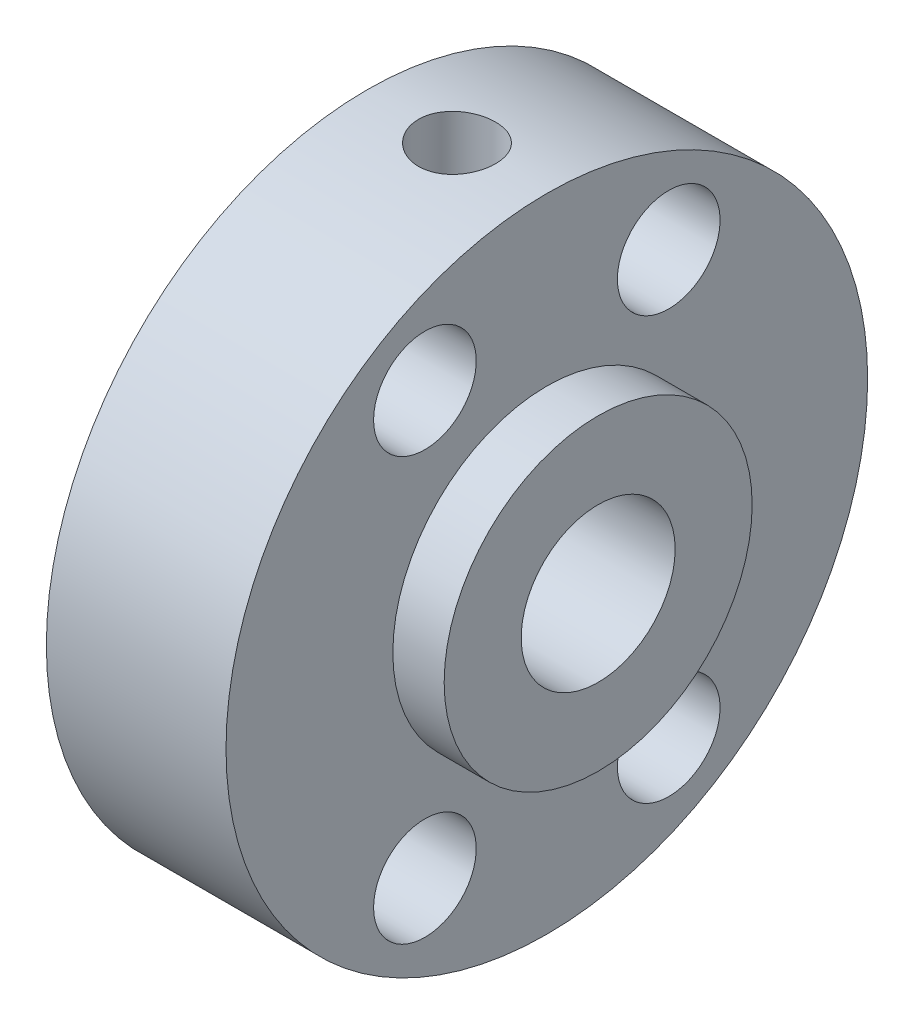
ISO-10303-21;
HEADER;
FILE_DESCRIPTION(('STEP AP214'),'2;1');
FILE_NAME('part.step','',(''),(''),'','','');
FILE_SCHEMA(('AUTOMOTIVE_DESIGN { 1 0 10303 214 1 1 1 1 }'));
ENDSEC;
DATA;
#1=APPLICATION_CONTEXT('core data for automotive mechanical design processes');
#2=APPLICATION_PROTOCOL_DEFINITION('international standard','automotive_design',2000,#1);
#3=PRODUCT_CONTEXT('',#1,'mechanical');
#4=PRODUCT('Part','Part','',(#3));
#5=PRODUCT_RELATED_PRODUCT_CATEGORY('part','',(#4));
#6=PRODUCT_DEFINITION_FORMATION('','',#4);
#7=PRODUCT_DEFINITION_CONTEXT('part definition',#1,'design');
#8=PRODUCT_DEFINITION('design','',#6,#7);
#9=PRODUCT_DEFINITION_SHAPE('','',#8);
#10=(LENGTH_UNIT() NAMED_UNIT(*) SI_UNIT(.MILLI.,.METRE.));
#11=(NAMED_UNIT(*) PLANE_ANGLE_UNIT() SI_UNIT($,.RADIAN.));
#12=(NAMED_UNIT(*) SI_UNIT($,.STERADIAN.) SOLID_ANGLE_UNIT());
#13=UNCERTAINTY_MEASURE_WITH_UNIT(LENGTH_MEASURE(1.E-05),#10,'distance_accuracy_value','');
#14=(GEOMETRIC_REPRESENTATION_CONTEXT(3) GLOBAL_UNCERTAINTY_ASSIGNED_CONTEXT((#13)) GLOBAL_UNIT_ASSIGNED_CONTEXT((#10,
#11,#12)) REPRESENTATION_CONTEXT('',''));
#15=CARTESIAN_POINT('',(0.,0.,0.));
#16=DIRECTION('',(0.,0.,1.));
#17=DIRECTION('',(1.,0.,0.));
#18=AXIS2_PLACEMENT_3D('',#15,#16,#17);
#19=CARTESIAN_POINT('',(0.,0.,0.));
#20=DIRECTION('',(-1.,0.,0.));
#21=DIRECTION('',(0.,0.,-1.));
#22=AXIS2_PLACEMENT_3D('',#19,#20,#21);
#23=CYLINDRICAL_SURFACE('',#22,3.);
#24=CARTESIAN_POINT('',(9.,0.,0.));
#25=DIRECTION('',(1.,0.,0.));
#26=DIRECTION('',(0.,0.,-1.));
#27=AXIS2_PLACEMENT_3D('',#24,#25,#26);
#28=CIRCLE('',#27,3.);
#29=CARTESIAN_POINT('',(9.,0.,-3.));
#30=VERTEX_POINT('',#29);
#31=EDGE_CURVE('E61',#30,#30,#28,.T.);
#32=ORIENTED_EDGE('',*,*,#31,.T.);
#33=EDGE_LOOP('',(#32));
#34=FACE_BOUND('',#33,.T.);
#35=CARTESIAN_POINT('',(0.,0.,0.));
#36=DIRECTION('',(1.,0.,0.));
#37=DIRECTION('',(0.,0.,-1.));
#38=AXIS2_PLACEMENT_3D('',#35,#36,#37);
#39=CIRCLE('',#38,3.);
#40=CARTESIAN_POINT('',(0.,0.,-3.));
#41=VERTEX_POINT('',#40);
#42=EDGE_CURVE('E10',#41,#41,#39,.T.);
#43=ORIENTED_EDGE('',*,*,#42,.F.);
#44=EDGE_LOOP('',(#43));
#45=FACE_BOUND('',#44,.T.);
#46=CARTESIAN_POINT('',(3.5,2.59807621135332,1.5));
#47=CARTESIAN_POINT('',(3.57816171229288,2.59808302092689,1.4999945446118));
#48=CARTESIAN_POINT('',(3.65642211728757,2.60165701781635,1.49384995609982));
#49=CARTESIAN_POINT('',(3.81054089701573,2.61543549678079,1.46958481484708));
#50=CARTESIAN_POINT('',(3.88639387256511,2.62565391083339,1.45143909683127));
#51=CARTESIAN_POINT('',(4.03317749651591,2.65124019908098,1.40414992304972));
#52=CARTESIAN_POINT('',(4.10413197871038,2.66658065209878,1.3750649287406));
#53=CARTESIAN_POINT('',(4.24013630299508,2.70063997225287,1.30690128806456));
#54=CARTESIAN_POINT('',(4.30518582539369,2.71935902214097,1.26782210105366));
#55=CARTESIAN_POINT('',(4.43345859283626,2.75995303586162,1.17699981079632));
#56=CARTESIAN_POINT('',(4.49608870351032,2.7819609545693,1.12447805421565));
#57=CARTESIAN_POINT('',(4.61211258261006,2.82557974178559,1.0098807114217));
#58=CARTESIAN_POINT('',(4.66550174387528,2.84719040746875,0.947800388673439));
#59=CARTESIAN_POINT('',(4.76505072672149,2.88932215429424,0.810734345121818));
#60=CARTESIAN_POINT('',(4.81048065178929,2.90967159627259,0.735160783518861));
#61=CARTESIAN_POINT('',(4.88771127986864,2.94526134149293,0.576235539899255));
#62=CARTESIAN_POINT('',(4.91952058420575,2.96050486775612,0.492888807207232));
#63=CARTESIAN_POINT('',(4.96625699195164,2.98320691866356,0.327067415888966));
#64=CARTESIAN_POINT('',(4.9822242895333,2.99114220331338,0.244952685733226));
#65=CARTESIAN_POINT('',(5.00024917801256,3.000113757691,0.0788559430467724));
#66=CARTESIAN_POINT('',(5.00231518519356,3.00115420176885,-0.00512490876560744));
#67=CARTESIAN_POINT('',(4.99287998904448,2.99644472874675,-0.164748786635625));
#68=CARTESIAN_POINT('',(4.98254297671817,2.99127743838241,-0.240481798765187));
#69=CARTESIAN_POINT('',(4.95067873414301,2.97561367889621,-0.388970657877483));
#70=CARTESIAN_POINT('',(4.92915066653566,2.96511681099591,-0.461726281640888));
#71=CARTESIAN_POINT('',(4.87537615086528,2.93957374931482,-0.60346408735433));
#72=CARTESIAN_POINT('',(4.8429855302419,2.92446662293799,-0.672380135272767));
#73=CARTESIAN_POINT('',(4.76860487569776,2.89106468980031,-0.803965202269992));
#74=CARTESIAN_POINT('',(4.72661140504647,2.87276874236226,-0.866631973257968));
#75=CARTESIAN_POINT('',(4.62965697270048,2.83266591598844,-0.990260491347292));
#76=CARTESIAN_POINT('',(4.57384545751099,2.81069063997263,-1.05050111254404));
#77=CARTESIAN_POINT('',(4.45311541260473,2.76681510880218,-1.16115655544667));
#78=CARTESIAN_POINT('',(4.38818994158891,2.74491492398443,-1.21156381736135));
#79=CARTESIAN_POINT('',(4.24602771136387,2.70216234138727,-1.30425800196332));
#80=CARTESIAN_POINT('',(4.16827096541868,2.68146479986061,-1.34582597246708));
#81=CARTESIAN_POINT('',(4.0055934929615,2.64563175417864,-1.41497866950185));
#82=CARTESIAN_POINT('',(3.92068035047366,2.63049045069101,-1.44257798731633));
#83=CARTESIAN_POINT('',(3.75317823307581,2.60916953725552,-1.48077031653756));
#84=CARTESIAN_POINT('',(3.67093832143467,2.60237483772745,-1.49253768317996));
#85=CARTESIAN_POINT('',(3.50539798772519,2.59676879042414,-1.50227541991714));
#86=CARTESIAN_POINT('',(3.42209835632032,2.59795180333967,-1.50025553597254));
#87=CARTESIAN_POINT('',(3.26651912213191,2.60751504810877,-1.48355406501595));
#88=CARTESIAN_POINT('',(3.19403082333811,2.61509381259981,-1.4702817250687));
#89=CARTESIAN_POINT('',(3.05244832059356,2.63541032327012,-1.43354442694866));
#90=CARTESIAN_POINT('',(2.98335522388009,2.64814974007551,-1.41007616793542));
#91=CARTESIAN_POINT('',(2.84688300364596,2.67804333119485,-1.35247138290733));
#92=CARTESIAN_POINT('',(2.77973147471967,2.69537464864595,-1.31789109553908));
#93=CARTESIAN_POINT('',(2.65179609269151,2.73234179245875,-1.23943059602371));
#94=CARTESIAN_POINT('',(2.59101553473008,2.75197880032721,-1.19554560649832));
#95=CARTESIAN_POINT('',(2.46953184871468,2.79431997684504,-1.09325575079828));
#96=CARTESIAN_POINT('',(2.40980427392351,2.81709874731434,-1.03371790847245));
#97=CARTESIAN_POINT('',(2.30088164300961,2.86101352466839,-0.905106743097433));
#98=CARTESIAN_POINT('',(2.25169014465419,2.88214897511564,-0.83603021198302));
#99=CARTESIAN_POINT('',(2.16413941107485,2.92112042536435,-0.687803043838135));
#100=CARTESIAN_POINT('',(2.12610032268364,2.93885462508044,-0.608434646361169));
#101=CARTESIAN_POINT('',(2.06429314421391,2.96825032438951,-0.443283546961623));
#102=CARTESIAN_POINT('',(2.04051252295054,2.97991715514559,-0.357506552088264));
#103=CARTESIAN_POINT('',(2.00994715373801,2.99501262272824,-0.190469523495626));
#104=CARTESIAN_POINT('',(2.00180318618583,2.99909891862287,-0.109517165775686));
#105=CARTESIAN_POINT('',(1.9987351018184,3.00063195562697,0.0526889789268051));
#106=CARTESIAN_POINT('',(2.00380635721466,2.99808102100335,0.13394265044263));
#107=CARTESIAN_POINT('',(2.02612461019344,2.98700953256884,0.28880698847572));
#108=CARTESIAN_POINT('',(2.04254727388651,2.97889342001985,0.362568476716895));
#109=CARTESIAN_POINT('',(2.08599049895446,2.95788140495135,0.506168928275426));
#110=CARTESIAN_POINT('',(2.11301258014018,2.94498481699194,0.576007327433263));
#111=CARTESIAN_POINT('',(2.17809057824896,2.9148889612218,0.713135109367326));
#112=CARTESIAN_POINT('',(2.21656898481176,2.89752925798199,0.780187714050069));
#113=CARTESIAN_POINT('',(2.30293689628858,2.86032199712739,0.907161962721036));
#114=CARTESIAN_POINT('',(2.35083072367351,2.84047329837541,0.96708031112236));
#115=CARTESIAN_POINT('',(2.46019570853405,2.79792915339941,1.08437100623534));
#116=CARTESIAN_POINT('',(2.52254373121579,2.77514698517547,1.14089652680891));
#117=CARTESIAN_POINT('',(2.65617608169466,2.73094614244278,1.24299493109201));
#118=CARTESIAN_POINT('',(2.72746823130153,2.70952868642798,1.28855812501509));
#119=CARTESIAN_POINT('',(2.87995496987143,2.66999407957374,1.36864661967848));
#120=CARTESIAN_POINT('',(2.9613912966931,2.65200261384405,1.40277759894141));
#121=CARTESIAN_POINT('',(3.12999860650967,2.62299234492527,1.45631806425962));
#122=CARTESIAN_POINT('',(3.21714933336903,2.61195024221553,1.47577678676302));
#123=CARTESIAN_POINT('',(3.33770803347799,2.60293908902686,1.49155051179662));
#124=CARTESIAN_POINT('',(3.37005184159682,2.60112193507728,1.49471415744578));
#125=CARTESIAN_POINT('',(3.43492472102337,2.59868903831625,1.49894010763494));
#126=CARTESIAN_POINT('',(3.46745380457881,2.59807337587664,1.50000227159981));
#127=CARTESIAN_POINT('',(3.5,2.59807621135332,1.5));
#128=B_SPLINE_CURVE_WITH_KNOTS('',3,(#46,#47,#48,#49,#50,#51,#52,#53,#54,#55,#56,#57,#58,#59,
#60,#61,#62,#63,#64,#65,#66,#67,#68,#69,#70,#71,#72,#73,#74,#75,#76,#77,#78,#79,#80,#81,#82,#83,
#84,#85,#86,#87,#88,#89,#90,#91,#92,#93,#94,#95,#96,#97,#98,#99,#100,#101,#102,#103,#104,#105,
#106,#107,#108,#109,#110,#111,#112,#113,#114,#115,#116,#117,#118,#119,#120,#121,#122,#123,#124,
#125,#126,#127),.UNSPECIFIED.,.T.,.F.,(4,2,2,2,2,2,2,2,2,2,2,2,2,2,2,2,2,2,2,2,2,2,2,2,2,2,2,2,
2,2,2,2,2,2,2,2,2,2,2,2,4),(0.,0.234348183892073,0.469189339237207,0.702792893878327,
0.936409088167724,1.18929346874735,1.44230356626556,1.71236838358145,1.98226240445836,
2.23295227451903,2.4834903552906,2.71224146226807,2.94100968776182,3.1729430209672,
3.40495949025407,3.65890787185336,3.91305072368878,4.18333262594172,4.45333161317557,
4.70193436281317,4.95036139782559,5.17161275136038,5.39293578654094,5.62450944609131,
5.85620229330071,6.11710115370919,6.37808797467303,6.64596272119448,6.91360169713157,
7.1566840558423,7.39968130190957,7.62666637307238,7.85368400268019,8.09041126079207,
8.32724745151078,8.587653627751,8.84828914267731,9.11716123557907,9.38512699504139,
9.48270202777963,9.5802835874181),.UNSPECIFIED.);
#129=CARTESIAN_POINT('',(3.5,2.59807621135332,1.5));
#130=VERTEX_POINT('',#129);
#131=EDGE_CURVE('E86',#130,#130,#128,.T.);
#132=ORIENTED_EDGE('',*,*,#131,.T.);
#133=EDGE_LOOP('',(#132));
#134=FACE_BOUND('',#133,.T.);
#135=ADVANCED_FACE('F33',(#34,#45,#134),#23,.F.);
#136=CARTESIAN_POINT('',(0.,0.,0.));
#137=DIRECTION('',(-1.,0.,0.));
#138=DIRECTION('',(0.,0.,-1.));
#139=AXIS2_PLACEMENT_3D('',#136,#137,#138);
#140=CYLINDRICAL_SURFACE('',#139,12.5);
#141=CARTESIAN_POINT('',(0.,0.,0.));
#142=DIRECTION('',(1.,0.,0.));
#143=DIRECTION('',(0.,0.,-1.));
#144=AXIS2_PLACEMENT_3D('',#141,#142,#143);
#145=CIRCLE('',#144,12.5);
#146=CARTESIAN_POINT('',(0.,0.,-12.5));
#147=VERTEX_POINT('',#146);
#148=EDGE_CURVE('E46',#147,#147,#145,.T.);
#149=ORIENTED_EDGE('',*,*,#148,.T.);
#150=EDGE_LOOP('',(#149));
#151=FACE_BOUND('',#150,.T.);
#152=CARTESIAN_POINT('',(7.,0.,0.));
#153=DIRECTION('',(1.,0.,0.));
#154=DIRECTION('',(0.,0.,-1.));
#155=AXIS2_PLACEMENT_3D('',#152,#153,#154);
#156=CIRCLE('',#155,12.5);
#157=CARTESIAN_POINT('',(7.,0.,-12.5));
#158=VERTEX_POINT('',#157);
#159=EDGE_CURVE('E50',#158,#158,#156,.T.);
#160=ORIENTED_EDGE('',*,*,#159,.F.);
#161=EDGE_LOOP('',(#160));
#162=FACE_BOUND('',#161,.T.);
#163=CARTESIAN_POINT('',(3.5,12.4096736459909,1.5));
#164=CARTESIAN_POINT('',(3.41607042940482,12.4096748089167,1.49999641586388));
#165=CARTESIAN_POINT('',(3.3320877399393,12.4105342894214,1.49293206748169));
#166=CARTESIAN_POINT('',(3.16645769398422,12.4138782255216,1.46486159354819));
#167=CARTESIAN_POINT('',(3.08481290215949,12.4163643992983,1.44384072619508));
#168=CARTESIAN_POINT('',(2.92628079724309,12.4226761552619,1.38848417307918));
#169=CARTESIAN_POINT('',(2.84939036943189,12.426500849368,1.35415731394874));
#170=CARTESIAN_POINT('',(2.70247642894952,12.4350576249844,1.27318168778971));
#171=CARTESIAN_POINT('',(2.63245170421602,12.4397895458966,1.22653510106007));
#172=CARTESIAN_POINT('',(2.50088011419491,12.4496550027324,1.12198571965019));
#173=CARTESIAN_POINT('',(2.4393738528257,12.4547902908254,1.06403198625323));
#174=CARTESIAN_POINT('',(2.32693564091905,12.4648680792729,0.938622932174393));
#175=CARTESIAN_POINT('',(2.2760042070291,12.4698105701984,0.871167147527067));
#176=CARTESIAN_POINT('',(2.18601673353186,12.4789637011531,0.728414784233987));
#177=CARTESIAN_POINT('',(2.14699729213018,12.4831720690333,0.653094976924494));
#178=CARTESIAN_POINT('',(2.08217576980763,12.4903635621621,0.496912883636388));
#179=CARTESIAN_POINT('',(2.05637323512614,12.4933467294733,0.41605078804277));
#180=CARTESIAN_POINT('',(2.01883887194828,12.4977393662263,0.25149392849254));
#181=CARTESIAN_POINT('',(2.00703967327712,12.4991563682204,0.167814735521689));
#182=CARTESIAN_POINT('',(1.99763820034474,12.5002827183051,-0.000347248334282976));
#183=CARTESIAN_POINT('',(2.00003540892089,12.4999921286017,-0.0848300098341701));
#184=CARTESIAN_POINT('',(2.01890456092568,12.4977421462633,-0.251742833758765));
#185=CARTESIAN_POINT('',(2.0353040524862,12.4957913442169,-0.334181218784106));
#186=CARTESIAN_POINT('',(2.081599075858,12.490449821119,-0.495127185045588));
#187=CARTESIAN_POINT('',(2.11149484709083,12.4870590745233,-0.573634696521302));
#188=CARTESIAN_POINT('',(2.18401136445326,12.4792038952277,-0.724715561629688));
#189=CARTESIAN_POINT('',(2.22666361800321,12.4747368094346,-0.797273648637692));
#190=CARTESIAN_POINT('',(2.32345944947808,12.465229048358,-0.934229460099392));
#191=CARTESIAN_POINT('',(2.37760351320781,12.4601883488298,-0.998626839383445));
#192=CARTESIAN_POINT('',(2.49625217477023,12.4500603372648,-1.11785860561525));
#193=CARTESIAN_POINT('',(2.56081989068675,12.4449729316271,-1.17263019439189));
#194=CARTESIAN_POINT('',(2.69826575683975,12.4353563023037,-1.27056795912578));
#195=CARTESIAN_POINT('',(2.77114392958224,12.4308270801297,-1.31373410365263));
#196=CARTESIAN_POINT('',(2.92319624507369,12.4228396027608,-1.38723839179325));
#197=CARTESIAN_POINT('',(3.00237272062895,12.4193817467283,-1.41757175578821));
#198=CARTESIAN_POINT('',(3.16474617975059,12.4139364153306,-1.46449505016189));
#199=CARTESIAN_POINT('',(3.24794298505965,12.4119488748366,-1.48108558929275));
#200=CARTESIAN_POINT('',(3.41544154818834,12.4096810007818,-1.49996964356083));
#201=CARTESIAN_POINT('',(3.49973321794057,12.4093901280317,-1.50235142135386));
#202=CARTESIAN_POINT('',(3.66751439042147,12.4105206650573,-1.49298299027801));
#203=CARTESIAN_POINT('',(3.75100390884369,12.411942041265,-1.48123305845624));
#204=CARTESIAN_POINT('',(3.91454789179899,12.4163273137489,-1.44400895971009));
#205=CARTESIAN_POINT('',(3.99461217340466,12.4192864301079,-1.41857731249469));
#206=CARTESIAN_POINT('',(4.14933964148798,12.4264098926624,-1.35475538396312));
#207=CARTESIAN_POINT('',(4.22400265225152,12.4305742780457,-1.31636468129306));
#208=CARTESIAN_POINT('',(4.36620814748731,12.4396643656649,-1.22749651360805));
#209=CARTESIAN_POINT('',(4.43371414344065,12.4445936804928,-1.17696103570738));
#210=CARTESIAN_POINT('',(4.5593175565059,12.4546467770184,-1.06532008918353));
#211=CARTESIAN_POINT('',(4.61741463670294,12.4597705656719,-1.0042142422181));
#212=CARTESIAN_POINT('',(4.72285987361746,12.4696675472455,-0.87278213633386));
#213=CARTESIAN_POINT('',(4.77015012325571,12.4744387628015,-0.802409249708916));
#214=CARTESIAN_POINT('',(4.85223910466455,12.483063621558,-0.654668214705289));
#215=CARTESIAN_POINT('',(4.88703807118722,12.4869172820019,-0.577300197822207));
#216=CARTESIAN_POINT('',(4.9430605024379,12.4932640215257,-0.417959622359992));
#217=CARTESIAN_POINT('',(4.96431775994212,12.4957604851314,-0.33599908532359));
#218=CARTESIAN_POINT('',(4.99276337179108,12.4991255682254,-0.169640292495738));
#219=CARTESIAN_POINT('',(4.99995230834657,12.4999942550783,-0.0852421377306299));
#220=CARTESIAN_POINT('',(5.00004692205616,12.5000056524324,0.0830300031278303));
#221=CARTESIAN_POINT('',(4.99304201834161,12.4991591682624,0.166903952329437));
#222=CARTESIAN_POINT('',(4.96513677254876,12.4958567701035,0.332273612398118));
#223=CARTESIAN_POINT('',(4.94423643502524,12.4934008566421,0.413769324044744));
#224=CARTESIAN_POINT('',(4.88916099243421,12.4871544009745,0.572059777991808));
#225=CARTESIAN_POINT('',(4.85498981777275,12.4833642539575,0.648855904373999));
#226=CARTESIAN_POINT('',(4.7743519652078,12.474869622158,0.795637705262655));
#227=CARTESIAN_POINT('',(4.72788518779857,12.4701651299761,0.865623324646851));
#228=CARTESIAN_POINT('',(4.62364315899687,12.4603319681132,0.997254742124291));
#229=CARTESIAN_POINT('',(4.56580132233712,12.4552009088046,1.0588476339384));
#230=CARTESIAN_POINT('',(4.44058848142378,12.4451123432295,1.17148865356204));
#231=CARTESIAN_POINT('',(4.37321521774934,12.4401548784622,1.22253427406543));
#232=CARTESIAN_POINT('',(4.23057853191475,12.4309559603764,1.31278537364373));
#233=CARTESIAN_POINT('',(4.15528783586352,12.4267171228205,1.35194799100155));
#234=CARTESIAN_POINT('',(3.99919112312461,12.419466118837,1.41701902911872));
#235=CARTESIAN_POINT('',(3.91839126440112,12.4164526081981,1.44294198213015));
#236=CARTESIAN_POINT('',(3.7809702304473,12.4127313618494,1.4745350503682));
#237=CARTESIAN_POINT('',(3.72521862402006,12.4115903654975,1.48407082470974));
#238=CARTESIAN_POINT('',(3.61298603393287,12.4100611186528,1.49680448454755));
#239=CARTESIAN_POINT('',(3.5565050552187,12.4096728630583,1.50000241299709));
#240=CARTESIAN_POINT('',(3.5,12.4096736459909,1.5));
#241=B_SPLINE_CURVE_WITH_KNOTS('',3,(#163,#164,#165,#166,#167,#168,#169,#170,#171,#172,#173,
#174,#175,#176,#177,#178,#179,#180,#181,#182,#183,#184,#185,#186,#187,#188,#189,#190,#191,#192,
#193,#194,#195,#196,#197,#198,#199,#200,#201,#202,#203,#204,#205,#206,#207,#208,#209,#210,#211,
#212,#213,#214,#215,#216,#217,#218,#219,#220,#221,#222,#223,#224,#225,#226,#227,#228,#229,#230,
#231,#232,#233,#234,#235,#236,#237,#238,#239,#240),.UNSPECIFIED.,.T.,.F.,(4,2,2,2,2,2,2,2,2,2,2,
2,2,2,2,2,2,2,2,2,2,2,2,2,2,2,2,2,2,2,2,2,2,2,2,2,2,2,4),(0.,0.25158230660961,0.503430774819312,
0.755112462522262,1.0067496383611,1.25954776660377,1.51235824273611,1.76593780876769,
2.01950866836447,2.27185458608052,2.52419131111312,2.77523023079344,3.02627360403335,
3.27794222677635,3.52962149067918,3.78288622204422,4.03615163930559,4.28951130338294,
4.54285974404081,4.79463277043148,5.0464008609825,5.29739099483104,5.54838929022027,
5.80061125155308,6.05284224246467,6.30639464647639,6.55994228515918,6.81285470170487,
7.06575665136928,7.31707030939075,7.56838388503437,7.81962308616497,8.07086432058376,
8.32362252061905,8.57644073759112,8.83016031080822,9.08360079205962,9.25297814464871,
9.42235434931908),.UNSPECIFIED.);
#242=CARTESIAN_POINT('',(3.5,12.4096736459909,1.5));
#243=VERTEX_POINT('',#242);
#244=EDGE_CURVE('E37',#243,#243,#241,.T.);
#245=ORIENTED_EDGE('',*,*,#244,.T.);
#246=EDGE_LOOP('',(#245));
#247=FACE_BOUND('',#246,.T.);
#248=ADVANCED_FACE('F127',(#151,#162,#247),#140,.T.);
#249=CARTESIAN_POINT('',(0.,3.,0.));
#250=DIRECTION('',(1.,0.,0.));
#251=DIRECTION('',(0.,0.,1.));
#252=AXIS2_PLACEMENT_3D('',#249,#250,#251);
#253=PLANE('',#252);
#254=CARTESIAN_POINT('',(0.,8.22724133595217,4.75000000000001));
#255=DIRECTION('',(-1.,0.,0.));
#256=DIRECTION('',(0.,0.,1.));
#257=AXIS2_PLACEMENT_3D('',#254,#255,#256);
#258=CIRCLE('',#257,2.);
#259=CARTESIAN_POINT('',(0.,8.22724133595217,6.75000000000001));
#260=VERTEX_POINT('',#259);
#261=EDGE_CURVE('E68',#260,#260,#258,.T.);
#262=ORIENTED_EDGE('',*,*,#261,.F.);
#263=EDGE_LOOP('',(#262));
#264=FACE_BOUND('',#263,.T.);
#265=CARTESIAN_POINT('',(0.,-8.22724133595218,-4.75000000000002));
#266=DIRECTION('',(-1.,0.,0.));
#267=DIRECTION('',(0.,0.,1.));
#268=AXIS2_PLACEMENT_3D('',#265,#266,#267);
#269=CIRCLE('',#268,2.);
#270=CARTESIAN_POINT('',(0.,-8.22724133595218,-2.75000000000002));
#271=VERTEX_POINT('',#270);
#272=EDGE_CURVE('E74',#271,#271,#269,.T.);
#273=ORIENTED_EDGE('',*,*,#272,.F.);
#274=EDGE_LOOP('',(#273));
#275=FACE_BOUND('',#274,.T.);
#276=CARTESIAN_POINT('',(0.,-8.22724133595216,4.75000000000002));
#277=DIRECTION('',(-1.,0.,0.));
#278=DIRECTION('',(0.,0.,1.));
#279=AXIS2_PLACEMENT_3D('',#276,#277,#278);
#280=CIRCLE('',#279,2.);
#281=CARTESIAN_POINT('',(0.,-8.22724133595216,6.75000000000002));
#282=VERTEX_POINT('',#281);
#283=EDGE_CURVE('E75',#282,#282,#280,.T.);
#284=ORIENTED_EDGE('',*,*,#283,.F.);
#285=EDGE_LOOP('',(#284));
#286=FACE_BOUND('',#285,.T.);
#287=CARTESIAN_POINT('',(0.,8.22724133595216,-4.75000000000001));
#288=DIRECTION('',(-1.,0.,0.));
#289=DIRECTION('',(0.,0.,1.));
#290=AXIS2_PLACEMENT_3D('',#287,#288,#289);
#291=CIRCLE('',#290,2.);
#292=CARTESIAN_POINT('',(0.,8.22724133595216,-2.75000000000001));
#293=VERTEX_POINT('',#292);
#294=EDGE_CURVE('E64',#293,#293,#291,.T.);
#295=ORIENTED_EDGE('',*,*,#294,.F.);
#296=EDGE_LOOP('',(#295));
#297=FACE_BOUND('',#296,.T.);
#298=ORIENTED_EDGE('',*,*,#42,.T.);
#299=EDGE_LOOP('',(#298));
#300=FACE_BOUND('',#299,.T.);
#301=ORIENTED_EDGE('',*,*,#148,.F.);
#302=EDGE_LOOP('',(#301));
#303=FACE_BOUND('',#302,.T.);
#304=ADVANCED_FACE('F125',(#264,#275,#286,#297,#300,#303),#253,.F.);
#305=CARTESIAN_POINT('',(7.,12.5,0.));
#306=DIRECTION('',(-1.,0.,0.));
#307=DIRECTION('',(0.,0.,-1.));
#308=AXIS2_PLACEMENT_3D('',#305,#306,#307);
#309=PLANE('',#308);
#310=CARTESIAN_POINT('',(7.,8.22724133595217,4.75000000000001));
#311=DIRECTION('',(-1.,0.,0.));
#312=DIRECTION('',(0.,0.,1.));
#313=AXIS2_PLACEMENT_3D('',#310,#311,#312);
#314=CIRCLE('',#313,2.);
#315=CARTESIAN_POINT('',(7.,8.22724133595217,6.75000000000001));
#316=VERTEX_POINT('',#315);
#317=EDGE_CURVE('E78',#316,#316,#314,.T.);
#318=ORIENTED_EDGE('',*,*,#317,.T.);
#319=EDGE_LOOP('',(#318));
#320=FACE_BOUND('',#319,.T.);
#321=CARTESIAN_POINT('',(7.,-8.22724133595218,-4.75000000000002));
#322=DIRECTION('',(-1.,0.,0.));
#323=DIRECTION('',(0.,0.,1.));
#324=AXIS2_PLACEMENT_3D('',#321,#322,#323);
#325=CIRCLE('',#324,2.);
#326=CARTESIAN_POINT('',(7.,-8.22724133595218,-2.75000000000002));
#327=VERTEX_POINT('',#326);
#328=EDGE_CURVE('E71',#327,#327,#325,.T.);
#329=ORIENTED_EDGE('',*,*,#328,.T.);
#330=EDGE_LOOP('',(#329));
#331=FACE_BOUND('',#330,.T.);
#332=CARTESIAN_POINT('',(7.,-8.22724133595216,4.75000000000002));
#333=DIRECTION('',(-1.,0.,0.));
#334=DIRECTION('',(0.,0.,1.));
#335=AXIS2_PLACEMENT_3D('',#332,#333,#334);
#336=CIRCLE('',#335,2.);
#337=CARTESIAN_POINT('',(7.,-8.22724133595216,6.75000000000002));
#338=VERTEX_POINT('',#337);
#339=EDGE_CURVE('E83',#338,#338,#336,.T.);
#340=ORIENTED_EDGE('',*,*,#339,.T.);
#341=EDGE_LOOP('',(#340));
#342=FACE_BOUND('',#341,.T.);
#343=CARTESIAN_POINT('',(7.,8.22724133595216,-4.75000000000001));
#344=DIRECTION('',(-1.,0.,0.));
#345=DIRECTION('',(0.,0.,1.));
#346=AXIS2_PLACEMENT_3D('',#343,#344,#345);
#347=CIRCLE('',#346,2.);
#348=CARTESIAN_POINT('',(7.,8.22724133595216,-2.75000000000001));
#349=VERTEX_POINT('',#348);
#350=EDGE_CURVE('E65',#349,#349,#347,.T.);
#351=ORIENTED_EDGE('',*,*,#350,.T.);
#352=EDGE_LOOP('',(#351));
#353=FACE_BOUND('',#352,.T.);
#354=ORIENTED_EDGE('',*,*,#159,.T.);
#355=EDGE_LOOP('',(#354));
#356=FACE_BOUND('',#355,.T.);
#357=CARTESIAN_POINT('',(7.,0.,0.));
#358=DIRECTION('',(1.,0.,0.));
#359=DIRECTION('',(0.,0.,-1.));
#360=AXIS2_PLACEMENT_3D('',#357,#358,#359);
#361=CIRCLE('',#360,6.);
#362=CARTESIAN_POINT('',(7.,0.,-6.));
#363=VERTEX_POINT('',#362);
#364=EDGE_CURVE('E55',#363,#363,#361,.T.);
#365=ORIENTED_EDGE('',*,*,#364,.F.);
#366=EDGE_LOOP('',(#365));
#367=FACE_BOUND('',#366,.T.);
#368=ADVANCED_FACE('F122',(#320,#331,#342,#353,#356,#367),#309,.F.);
#369=CARTESIAN_POINT('',(0.,0.,0.));
#370=DIRECTION('',(-1.,0.,0.));
#371=DIRECTION('',(0.,0.,-1.));
#372=AXIS2_PLACEMENT_3D('',#369,#370,#371);
#373=CYLINDRICAL_SURFACE('',#372,6.);
#374=ORIENTED_EDGE('',*,*,#364,.T.);
#375=EDGE_LOOP('',(#374));
#376=FACE_BOUND('',#375,.T.);
#377=CARTESIAN_POINT('',(9.,0.,0.));
#378=DIRECTION('',(1.,0.,0.));
#379=DIRECTION('',(0.,0.,-1.));
#380=AXIS2_PLACEMENT_3D('',#377,#378,#379);
#381=CIRCLE('',#380,6.);
#382=CARTESIAN_POINT('',(9.,0.,-6.));
#383=VERTEX_POINT('',#382);
#384=EDGE_CURVE('E58',#383,#383,#381,.T.);
#385=ORIENTED_EDGE('',*,*,#384,.F.);
#386=EDGE_LOOP('',(#385));
#387=FACE_BOUND('',#386,.T.);
#388=ADVANCED_FACE('F118',(#376,#387),#373,.T.);
#389=CARTESIAN_POINT('',(9.,6.,0.));
#390=DIRECTION('',(-1.,0.,0.));
#391=DIRECTION('',(0.,0.,-1.));
#392=AXIS2_PLACEMENT_3D('',#389,#390,#391);
#393=PLANE('',#392);
#394=ORIENTED_EDGE('',*,*,#384,.T.);
#395=EDGE_LOOP('',(#394));
#396=FACE_BOUND('',#395,.T.);
#397=ORIENTED_EDGE('',*,*,#31,.F.);
#398=EDGE_LOOP('',(#397));
#399=FACE_BOUND('',#398,.T.);
#400=ADVANCED_FACE('F114',(#396,#399),#393,.F.);
#401=CARTESIAN_POINT('',(0.,8.22724133595216,-4.75000000000001));
#402=DIRECTION('',(1.,0.,0.));
#403=DIRECTION('',(0.,0.,1.));
#404=AXIS2_PLACEMENT_3D('',#401,#402,#403);
#405=CYLINDRICAL_SURFACE('',#404,2.);
#406=ORIENTED_EDGE('',*,*,#294,.T.);
#407=EDGE_LOOP('',(#406));
#408=FACE_BOUND('',#407,.T.);
#409=ORIENTED_EDGE('',*,*,#350,.F.);
#410=EDGE_LOOP('',(#409));
#411=FACE_BOUND('',#410,.T.);
#412=ADVANCED_FACE('F104',(#408,#411),#405,.F.);
#413=CARTESIAN_POINT('',(0.,-8.22724133595216,4.75000000000002));
#414=DIRECTION('',(1.,0.,0.));
#415=DIRECTION('',(0.,0.,1.));
#416=AXIS2_PLACEMENT_3D('',#413,#414,#415);
#417=CYLINDRICAL_SURFACE('',#416,2.);
#418=ORIENTED_EDGE('',*,*,#283,.T.);
#419=EDGE_LOOP('',(#418));
#420=FACE_BOUND('',#419,.T.);
#421=ORIENTED_EDGE('',*,*,#339,.F.);
#422=EDGE_LOOP('',(#421));
#423=FACE_BOUND('',#422,.T.);
#424=ADVANCED_FACE('F99',(#420,#423),#417,.F.);
#425=CARTESIAN_POINT('',(0.,-8.22724133595218,-4.75000000000002));
#426=DIRECTION('',(1.,0.,0.));
#427=DIRECTION('',(0.,0.,1.));
#428=AXIS2_PLACEMENT_3D('',#425,#426,#427);
#429=CYLINDRICAL_SURFACE('',#428,2.);
#430=ORIENTED_EDGE('',*,*,#272,.T.);
#431=EDGE_LOOP('',(#430));
#432=FACE_BOUND('',#431,.T.);
#433=ORIENTED_EDGE('',*,*,#328,.F.);
#434=EDGE_LOOP('',(#433));
#435=FACE_BOUND('',#434,.T.);
#436=ADVANCED_FACE('F103',(#432,#435),#429,.F.);
#437=CARTESIAN_POINT('',(0.,8.22724133595217,4.75000000000001));
#438=DIRECTION('',(1.,0.,0.));
#439=DIRECTION('',(0.,0.,1.));
#440=AXIS2_PLACEMENT_3D('',#437,#438,#439);
#441=CYLINDRICAL_SURFACE('',#440,2.);
#442=ORIENTED_EDGE('',*,*,#261,.T.);
#443=EDGE_LOOP('',(#442));
#444=FACE_BOUND('',#443,.T.);
#445=ORIENTED_EDGE('',*,*,#317,.F.);
#446=EDGE_LOOP('',(#445));
#447=FACE_BOUND('',#446,.T.);
#448=ADVANCED_FACE('F97',(#444,#447),#441,.F.);
#449=CARTESIAN_POINT('',(3.5,30.,0.));
#450=DIRECTION('',(0.,-1.,0.));
#451=DIRECTION('',(0.,0.,1.));
#452=AXIS2_PLACEMENT_3D('',#449,#450,#451);
#453=CYLINDRICAL_SURFACE('',#452,1.5);
#454=ORIENTED_EDGE('',*,*,#244,.F.);
#455=EDGE_LOOP('',(#454));
#456=FACE_BOUND('',#455,.T.);
#457=ORIENTED_EDGE('',*,*,#131,.F.);
#458=EDGE_LOOP('',(#457));
#459=FACE_BOUND('',#458,.T.);
#460=ADVANCED_FACE('F93',(#456,#459),#453,.F.);
#461=CLOSED_SHELL('',(#135,#248,#304,#368,#388,#400,#412,#424,#436,#448,#460));
#462=MANIFOLD_SOLID_BREP('B2',#461);
#463=ADVANCED_BREP_SHAPE_REPRESENTATION('',(#18,#462),#14);
#464=SHAPE_DEFINITION_REPRESENTATION(#9,#463);
ENDSEC;
END-ISO-10303-21;
